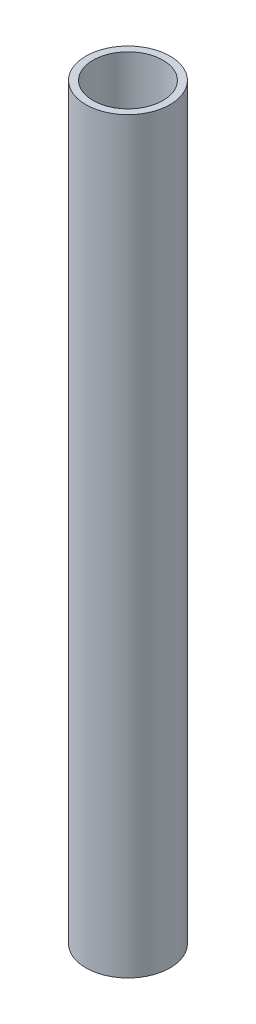
ISO-10303-21;
HEADER;
FILE_DESCRIPTION(('STEP AP214'),'2;1');
FILE_NAME('part.step','',(''),(''),'','','');
FILE_SCHEMA(('AUTOMOTIVE_DESIGN { 1 0 10303 214 1 1 1 1 }'));
ENDSEC;
DATA;
#1=APPLICATION_CONTEXT('core data for automotive mechanical design processes');
#2=APPLICATION_PROTOCOL_DEFINITION('international standard','automotive_design',2000,#1);
#3=PRODUCT_CONTEXT('',#1,'mechanical');
#4=PRODUCT('Part','Part','',(#3));
#5=PRODUCT_RELATED_PRODUCT_CATEGORY('part','',(#4));
#6=PRODUCT_DEFINITION_FORMATION('','',#4);
#7=PRODUCT_DEFINITION_CONTEXT('part definition',#1,'design');
#8=PRODUCT_DEFINITION('design','',#6,#7);
#9=PRODUCT_DEFINITION_SHAPE('','',#8);
#10=(LENGTH_UNIT() NAMED_UNIT(*) SI_UNIT(.MILLI.,.METRE.));
#11=(NAMED_UNIT(*) PLANE_ANGLE_UNIT() SI_UNIT($,.RADIAN.));
#12=(NAMED_UNIT(*) SI_UNIT($,.STERADIAN.) SOLID_ANGLE_UNIT());
#13=UNCERTAINTY_MEASURE_WITH_UNIT(LENGTH_MEASURE(1.E-05),#10,'distance_accuracy_value','');
#14=(GEOMETRIC_REPRESENTATION_CONTEXT(3) GLOBAL_UNCERTAINTY_ASSIGNED_CONTEXT((#13)) GLOBAL_UNIT_ASSIGNED_CONTEXT((#10,
#11,#12)) REPRESENTATION_CONTEXT('',''));
#15=CARTESIAN_POINT('',(0.,0.,0.));
#16=DIRECTION('',(0.,0.,1.));
#17=DIRECTION('',(1.,0.,0.));
#18=AXIS2_PLACEMENT_3D('',#15,#16,#17);
#19=CARTESIAN_POINT('',(0.,374.65,0.));
#20=DIRECTION('',(0.,1.,0.));
#21=DIRECTION('',(0.,0.,1.));
#22=AXIS2_PLACEMENT_3D('',#19,#20,#21);
#23=PLANE('',#22);
#24=CARTESIAN_POINT('',(0.,374.65,0.));
#25=DIRECTION('',(0.,1.,0.));
#26=DIRECTION('',(0.,0.,1.));
#27=AXIS2_PLACEMENT_3D('',#24,#25,#26);
#28=CIRCLE('',#27,21.082);
#29=CARTESIAN_POINT('',(0.,374.65,21.082));
#30=VERTEX_POINT('',#29);
#31=EDGE_CURVE('E10',#30,#30,#28,.T.);
#32=ORIENTED_EDGE('',*,*,#31,.T.);
#33=EDGE_LOOP('',(#32));
#34=FACE_BOUND('',#33,.T.);
#35=CARTESIAN_POINT('',(0.,374.65,0.));
#36=DIRECTION('',(0.,1.,0.));
#37=DIRECTION('',(0.,0.,1.));
#38=AXIS2_PLACEMENT_3D('',#35,#36,#37);
#39=CIRCLE('',#38,17.526);
#40=CARTESIAN_POINT('',(0.,374.65,17.526));
#41=VERTEX_POINT('',#40);
#42=EDGE_CURVE('E41',#41,#41,#39,.T.);
#43=ORIENTED_EDGE('',*,*,#42,.F.);
#44=EDGE_LOOP('',(#43));
#45=FACE_BOUND('',#44,.T.);
#46=ADVANCED_FACE('F30',(#34,#45),#23,.T.);
#47=CARTESIAN_POINT('',(0.,0.,0.));
#48=DIRECTION('',(0.,1.,0.));
#49=DIRECTION('',(0.,0.,1.));
#50=AXIS2_PLACEMENT_3D('',#47,#48,#49);
#51=PLANE('',#50);
#52=CARTESIAN_POINT('',(0.,0.,0.));
#53=DIRECTION('',(0.,1.,0.));
#54=DIRECTION('',(0.,0.,1.));
#55=AXIS2_PLACEMENT_3D('',#52,#53,#54);
#56=CIRCLE('',#55,21.082);
#57=CARTESIAN_POINT('',(0.,0.,21.082));
#58=VERTEX_POINT('',#57);
#59=EDGE_CURVE('E34',#58,#58,#56,.T.);
#60=ORIENTED_EDGE('',*,*,#59,.F.);
#61=EDGE_LOOP('',(#60));
#62=FACE_BOUND('',#61,.T.);
#63=CARTESIAN_POINT('',(0.,0.,0.));
#64=DIRECTION('',(0.,1.,0.));
#65=DIRECTION('',(0.,0.,1.));
#66=AXIS2_PLACEMENT_3D('',#63,#64,#65);
#67=CIRCLE('',#66,17.526);
#68=CARTESIAN_POINT('',(0.,0.,17.526));
#69=VERTEX_POINT('',#68);
#70=EDGE_CURVE('E43',#69,#69,#67,.T.);
#71=ORIENTED_EDGE('',*,*,#70,.T.);
#72=EDGE_LOOP('',(#71));
#73=FACE_BOUND('',#72,.T.);
#74=ADVANCED_FACE('F53',(#62,#73),#51,.F.);
#75=CARTESIAN_POINT('',(0.,374.65,0.));
#76=DIRECTION('',(0.,-1.,0.));
#77=DIRECTION('',(0.,0.,-1.));
#78=AXIS2_PLACEMENT_3D('',#75,#76,#77);
#79=CYLINDRICAL_SURFACE('',#78,21.082);
#80=ORIENTED_EDGE('',*,*,#31,.F.);
#81=EDGE_LOOP('',(#80));
#82=FACE_BOUND('',#81,.T.);
#83=ORIENTED_EDGE('',*,*,#59,.T.);
#84=EDGE_LOOP('',(#83));
#85=FACE_BOUND('',#84,.T.);
#86=ADVANCED_FACE('F32',(#82,#85),#79,.T.);
#87=CARTESIAN_POINT('',(0.,374.65,0.));
#88=DIRECTION('',(0.,-1.,0.));
#89=DIRECTION('',(0.,0.,-1.));
#90=AXIS2_PLACEMENT_3D('',#87,#88,#89);
#91=CYLINDRICAL_SURFACE('',#90,17.526);
#92=ORIENTED_EDGE('',*,*,#42,.T.);
#93=EDGE_LOOP('',(#92));
#94=FACE_BOUND('',#93,.T.);
#95=ORIENTED_EDGE('',*,*,#70,.F.);
#96=EDGE_LOOP('',(#95));
#97=FACE_BOUND('',#96,.T.);
#98=ADVANCED_FACE('F49',(#94,#97),#91,.F.);
#99=CLOSED_SHELL('',(#46,#74,#86,#98));
#100=MANIFOLD_SOLID_BREP('B2',#99);
#101=ADVANCED_BREP_SHAPE_REPRESENTATION('',(#18,#100),#14);
#102=SHAPE_DEFINITION_REPRESENTATION(#9,#101);
ENDSEC;
END-ISO-10303-21;
